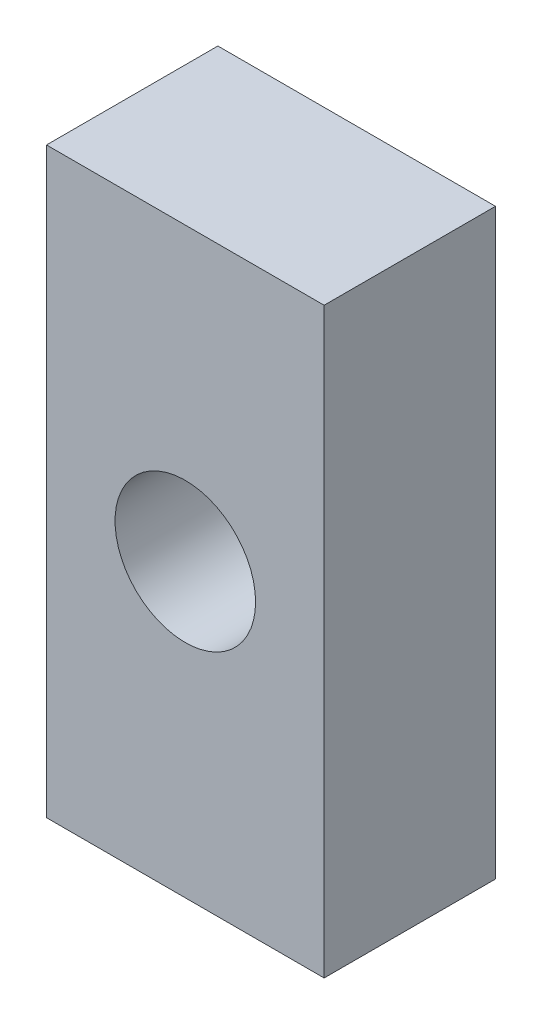
ISO-10303-21;
HEADER;
FILE_DESCRIPTION(('STEP AP214'),'2;1');
FILE_NAME('part.step','',(''),(''),'','','');
FILE_SCHEMA(('AUTOMOTIVE_DESIGN { 1 0 10303 214 1 1 1 1 }'));
ENDSEC;
DATA;
#1=APPLICATION_CONTEXT('core data for automotive mechanical design processes');
#2=APPLICATION_PROTOCOL_DEFINITION('international standard','automotive_design',2000,#1);
#3=PRODUCT_CONTEXT('',#1,'mechanical');
#4=PRODUCT('Part','Part','',(#3));
#5=PRODUCT_RELATED_PRODUCT_CATEGORY('part','',(#4));
#6=PRODUCT_DEFINITION_FORMATION('','',#4);
#7=PRODUCT_DEFINITION_CONTEXT('part definition',#1,'design');
#8=PRODUCT_DEFINITION('design','',#6,#7);
#9=PRODUCT_DEFINITION_SHAPE('','',#8);
#10=(LENGTH_UNIT() NAMED_UNIT(*) SI_UNIT(.MILLI.,.METRE.));
#11=(NAMED_UNIT(*) PLANE_ANGLE_UNIT() SI_UNIT($,.RADIAN.));
#12=(NAMED_UNIT(*) SI_UNIT($,.STERADIAN.) SOLID_ANGLE_UNIT());
#13=UNCERTAINTY_MEASURE_WITH_UNIT(LENGTH_MEASURE(1.E-05),#10,'distance_accuracy_value','');
#14=(GEOMETRIC_REPRESENTATION_CONTEXT(3) GLOBAL_UNCERTAINTY_ASSIGNED_CONTEXT((#13)) GLOBAL_UNIT_ASSIGNED_CONTEXT((#10,
#11,#12)) REPRESENTATION_CONTEXT('',''));
#15=CARTESIAN_POINT('',(0.,0.,0.));
#16=DIRECTION('',(0.,0.,1.));
#17=DIRECTION('',(1.,0.,0.));
#18=AXIS2_PLACEMENT_3D('',#15,#16,#17);
#19=CARTESIAN_POINT('',(0.,0.,5.));
#20=DIRECTION('',(0.,0.,1.));
#21=DIRECTION('',(1.,0.,0.));
#22=AXIS2_PLACEMENT_3D('',#19,#20,#21);
#23=PLANE('',#22);
#24=DIRECTION('',(0.,-1.,0.));
#25=VECTOR('',#24,1.);
#26=CARTESIAN_POINT('',(-18.5,-8.5,5.));
#27=LINE('',#26,#25);
#28=CARTESIAN_POINT('',(-18.5,8.5,5.));
#29=VERTEX_POINT('',#28);
#30=CARTESIAN_POINT('',(-18.5,-8.5,5.));
#31=VERTEX_POINT('',#30);
#32=EDGE_CURVE('E88',#29,#31,#27,.T.);
#33=ORIENTED_EDGE('',*,*,#32,.T.);
#34=DIRECTION('',(1.,0.,0.));
#35=VECTOR('',#34,1.);
#36=CARTESIAN_POINT('',(-10.4,-8.5,5.));
#37=LINE('',#36,#35);
#38=CARTESIAN_POINT('',(-10.4,-8.5,5.));
#39=VERTEX_POINT('',#38);
#40=EDGE_CURVE('E83',#31,#39,#37,.T.);
#41=ORIENTED_EDGE('',*,*,#40,.T.);
#42=DIRECTION('',(0.,1.,0.));
#43=VECTOR('',#42,1.);
#44=CARTESIAN_POINT('',(-10.4,-8.5,5.));
#45=LINE('',#44,#43);
#46=CARTESIAN_POINT('',(-10.4,8.5,5.));
#47=VERTEX_POINT('',#46);
#48=EDGE_CURVE('E86',#39,#47,#45,.T.);
#49=ORIENTED_EDGE('',*,*,#48,.T.);
#50=DIRECTION('',(-1.,0.,0.));
#51=VECTOR('',#50,1.);
#52=CARTESIAN_POINT('',(-10.4,8.5,5.));
#53=LINE('',#52,#51);
#54=EDGE_CURVE('E53',#47,#29,#53,.T.);
#55=ORIENTED_EDGE('',*,*,#54,.T.);
#56=EDGE_LOOP('',(#33,#41,#49,#55));
#57=FACE_BOUND('',#56,.T.);
#58=CARTESIAN_POINT('',(-14.45,0.,5.));
#59=DIRECTION('',(0.,0.,1.));
#60=DIRECTION('',(1.,0.,0.));
#61=AXIS2_PLACEMENT_3D('',#58,#59,#60);
#62=CIRCLE('',#61,2.05);
#63=CARTESIAN_POINT('',(-12.4,0.,5.));
#64=VERTEX_POINT('',#63);
#65=EDGE_CURVE('E103',#64,#64,#62,.T.);
#66=ORIENTED_EDGE('',*,*,#65,.F.);
#67=EDGE_LOOP('',(#66));
#68=FACE_BOUND('',#67,.T.);
#69=ADVANCED_FACE('F36',(#57,#68),#23,.T.);
#70=CARTESIAN_POINT('',(0.,0.,0.));
#71=DIRECTION('',(0.,0.,1.));
#72=DIRECTION('',(1.,0.,0.));
#73=AXIS2_PLACEMENT_3D('',#70,#71,#72);
#74=PLANE('',#73);
#75=DIRECTION('',(0.,-1.,0.));
#76=VECTOR('',#75,1.);
#77=CARTESIAN_POINT('',(-18.5,-8.5,0.));
#78=LINE('',#77,#76);
#79=CARTESIAN_POINT('',(-18.5,8.5,0.));
#80=VERTEX_POINT('',#79);
#81=CARTESIAN_POINT('',(-18.5,-8.5,0.));
#82=VERTEX_POINT('',#81);
#83=EDGE_CURVE('E100',#80,#82,#78,.T.);
#84=ORIENTED_EDGE('',*,*,#83,.F.);
#85=DIRECTION('',(-1.,0.,0.));
#86=VECTOR('',#85,1.);
#87=CARTESIAN_POINT('',(-10.4,8.5,0.));
#88=LINE('',#87,#86);
#89=CARTESIAN_POINT('',(-10.4,8.5,0.));
#90=VERTEX_POINT('',#89);
#91=EDGE_CURVE('E76',#90,#80,#88,.T.);
#92=ORIENTED_EDGE('',*,*,#91,.F.);
#93=DIRECTION('',(0.,1.,0.));
#94=VECTOR('',#93,1.);
#95=CARTESIAN_POINT('',(-10.4,-8.5,0.));
#96=LINE('',#95,#94);
#97=CARTESIAN_POINT('',(-10.4,-8.5,0.));
#98=VERTEX_POINT('',#97);
#99=EDGE_CURVE('E70',#98,#90,#96,.T.);
#100=ORIENTED_EDGE('',*,*,#99,.F.);
#101=DIRECTION('',(1.,0.,0.));
#102=VECTOR('',#101,1.);
#103=CARTESIAN_POINT('',(-10.4,-8.5,0.));
#104=LINE('',#103,#102);
#105=EDGE_CURVE('E92',#82,#98,#104,.T.);
#106=ORIENTED_EDGE('',*,*,#105,.F.);
#107=EDGE_LOOP('',(#84,#92,#100,#106));
#108=FACE_BOUND('',#107,.T.);
#109=CARTESIAN_POINT('',(-14.45,0.,0.));
#110=DIRECTION('',(0.,0.,1.));
#111=DIRECTION('',(1.,0.,0.));
#112=AXIS2_PLACEMENT_3D('',#109,#110,#111);
#113=CIRCLE('',#112,2.05);
#114=CARTESIAN_POINT('',(-12.4,0.,0.));
#115=VERTEX_POINT('',#114);
#116=EDGE_CURVE('E115',#115,#115,#113,.T.);
#117=ORIENTED_EDGE('',*,*,#116,.T.);
#118=EDGE_LOOP('',(#117));
#119=FACE_BOUND('',#118,.T.);
#120=ADVANCED_FACE('F111',(#108,#119),#74,.F.);
#121=CARTESIAN_POINT('',(-18.5,-8.5,5.));
#122=DIRECTION('',(1.,0.,0.));
#123=DIRECTION('',(0.,0.,-1.));
#124=AXIS2_PLACEMENT_3D('',#121,#122,#123);
#125=PLANE('',#124);
#126=ORIENTED_EDGE('',*,*,#83,.T.);
#127=DIRECTION('',(0.,0.,-1.));
#128=VECTOR('',#127,1.);
#129=CARTESIAN_POINT('',(-18.5,-8.5,5.));
#130=LINE('',#129,#128);
#131=EDGE_CURVE('E11',#31,#82,#130,.T.);
#132=ORIENTED_EDGE('',*,*,#131,.F.);
#133=ORIENTED_EDGE('',*,*,#32,.F.);
#134=DIRECTION('',(0.,0.,-1.));
#135=VECTOR('',#134,1.);
#136=CARTESIAN_POINT('',(-18.5,8.5,5.));
#137=LINE('',#136,#135);
#138=EDGE_CURVE('E96',#29,#80,#137,.T.);
#139=ORIENTED_EDGE('',*,*,#138,.T.);
#140=EDGE_LOOP('',(#126,#132,#133,#139));
#141=FACE_BOUND('',#140,.T.);
#142=ADVANCED_FACE('F38',(#141),#125,.F.);
#143=CARTESIAN_POINT('',(-10.4,-8.5,5.));
#144=DIRECTION('',(0.,1.,0.));
#145=DIRECTION('',(0.,0.,1.));
#146=AXIS2_PLACEMENT_3D('',#143,#144,#145);
#147=PLANE('',#146);
#148=ORIENTED_EDGE('',*,*,#105,.T.);
#149=DIRECTION('',(0.,0.,-1.));
#150=VECTOR('',#149,1.);
#151=CARTESIAN_POINT('',(-10.4,-8.5,5.));
#152=LINE('',#151,#150);
#153=EDGE_CURVE('E45',#39,#98,#152,.T.);
#154=ORIENTED_EDGE('',*,*,#153,.F.);
#155=ORIENTED_EDGE('',*,*,#40,.F.);
#156=ORIENTED_EDGE('',*,*,#131,.T.);
#157=EDGE_LOOP('',(#148,#154,#155,#156));
#158=FACE_BOUND('',#157,.T.);
#159=ADVANCED_FACE('F91',(#158),#147,.F.);
#160=CARTESIAN_POINT('',(-10.4,-8.5,5.));
#161=DIRECTION('',(-1.,0.,0.));
#162=DIRECTION('',(0.,0.,1.));
#163=AXIS2_PLACEMENT_3D('',#160,#161,#162);
#164=PLANE('',#163);
#165=ORIENTED_EDGE('',*,*,#99,.T.);
#166=DIRECTION('',(0.,0.,-1.));
#167=VECTOR('',#166,1.);
#168=CARTESIAN_POINT('',(-10.4,8.5,5.));
#169=LINE('',#168,#167);
#170=EDGE_CURVE('E93',#47,#90,#169,.T.);
#171=ORIENTED_EDGE('',*,*,#170,.F.);
#172=ORIENTED_EDGE('',*,*,#48,.F.);
#173=ORIENTED_EDGE('',*,*,#153,.T.);
#174=EDGE_LOOP('',(#165,#171,#172,#173));
#175=FACE_BOUND('',#174,.T.);
#176=ADVANCED_FACE('F94',(#175),#164,.F.);
#177=CARTESIAN_POINT('',(-10.4,8.5,5.));
#178=DIRECTION('',(0.,-1.,0.));
#179=DIRECTION('',(0.,0.,-1.));
#180=AXIS2_PLACEMENT_3D('',#177,#178,#179);
#181=PLANE('',#180);
#182=ORIENTED_EDGE('',*,*,#91,.T.);
#183=ORIENTED_EDGE('',*,*,#138,.F.);
#184=ORIENTED_EDGE('',*,*,#54,.F.);
#185=ORIENTED_EDGE('',*,*,#170,.T.);
#186=EDGE_LOOP('',(#182,#183,#184,#185));
#187=FACE_BOUND('',#186,.T.);
#188=ADVANCED_FACE('F108',(#187),#181,.F.);
#189=CARTESIAN_POINT('',(-14.45,0.,5.));
#190=DIRECTION('',(0.,0.,-1.));
#191=DIRECTION('',(-1.,0.,0.));
#192=AXIS2_PLACEMENT_3D('',#189,#190,#191);
#193=CYLINDRICAL_SURFACE('',#192,2.05);
#194=ORIENTED_EDGE('',*,*,#65,.T.);
#195=EDGE_LOOP('',(#194));
#196=FACE_BOUND('',#195,.T.);
#197=ORIENTED_EDGE('',*,*,#116,.F.);
#198=EDGE_LOOP('',(#197));
#199=FACE_BOUND('',#198,.T.);
#200=ADVANCED_FACE('F121',(#196,#199),#193,.F.);
#201=CLOSED_SHELL('',(#69,#120,#142,#159,#176,#188,#200));
#202=MANIFOLD_SOLID_BREP('B2',#201);
#203=ADVANCED_BREP_SHAPE_REPRESENTATION('',(#18,#202),#14);
#204=SHAPE_DEFINITION_REPRESENTATION(#9,#203);
ENDSEC;
END-ISO-10303-21;
